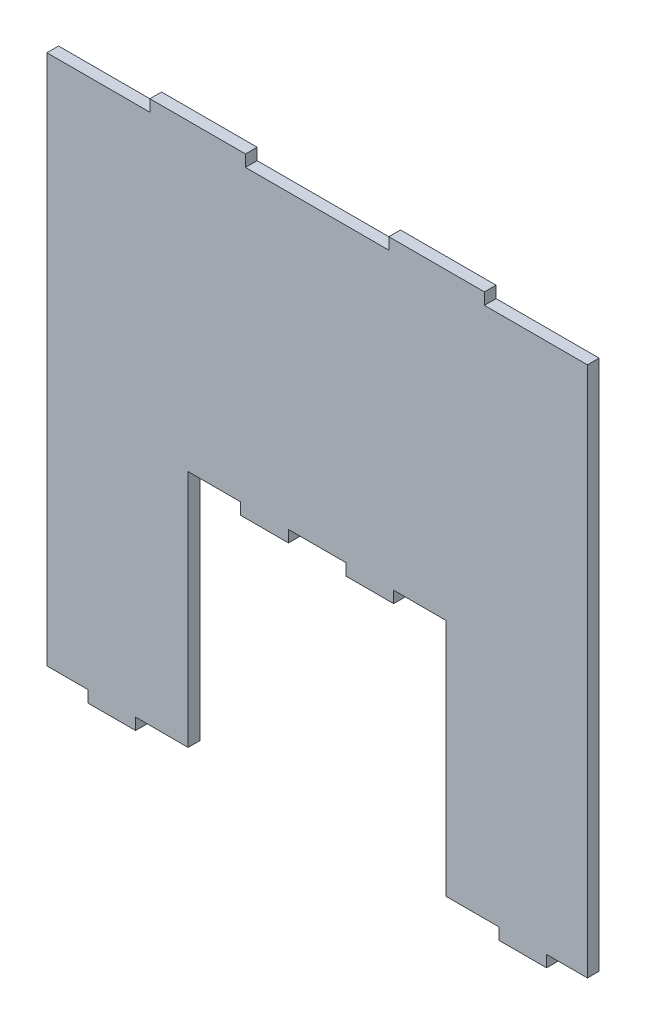
ISO-10303-21;
HEADER;
FILE_DESCRIPTION(('STEP AP214'),'2;1');
FILE_NAME('part.step','',(''),(''),'','','');
FILE_SCHEMA(('AUTOMOTIVE_DESIGN { 1 0 10303 214 1 1 1 1 }'));
ENDSEC;
DATA;
#1=APPLICATION_CONTEXT('core data for automotive mechanical design processes');
#2=APPLICATION_PROTOCOL_DEFINITION('international standard','automotive_design',2000,#1);
#3=PRODUCT_CONTEXT('',#1,'mechanical');
#4=PRODUCT('Part','Part','',(#3));
#5=PRODUCT_RELATED_PRODUCT_CATEGORY('part','',(#4));
#6=PRODUCT_DEFINITION_FORMATION('','',#4);
#7=PRODUCT_DEFINITION_CONTEXT('part definition',#1,'design');
#8=PRODUCT_DEFINITION('design','',#6,#7);
#9=PRODUCT_DEFINITION_SHAPE('','',#8);
#10=(LENGTH_UNIT() NAMED_UNIT(*) SI_UNIT(.MILLI.,.METRE.));
#11=(NAMED_UNIT(*) PLANE_ANGLE_UNIT() SI_UNIT($,.RADIAN.));
#12=(NAMED_UNIT(*) SI_UNIT($,.STERADIAN.) SOLID_ANGLE_UNIT());
#13=UNCERTAINTY_MEASURE_WITH_UNIT(LENGTH_MEASURE(1.E-05),#10,'distance_accuracy_value','');
#14=(GEOMETRIC_REPRESENTATION_CONTEXT(3) GLOBAL_UNCERTAINTY_ASSIGNED_CONTEXT((#13)) GLOBAL_UNIT_ASSIGNED_CONTEXT((#10,
#11,#12)) REPRESENTATION_CONTEXT('',''));
#15=CARTESIAN_POINT('',(0.,0.,0.));
#16=DIRECTION('',(0.,0.,1.));
#17=DIRECTION('',(1.,0.,0.));
#18=AXIS2_PLACEMENT_3D('',#15,#16,#17);
#19=CARTESIAN_POINT('',(35.,55.56,2.44));
#20=DIRECTION('',(0.,-1.,0.));
#21=DIRECTION('',(1.,0.,0.));
#22=AXIS2_PLACEMENT_3D('',#19,#20,#21);
#23=PLANE('',#22);
#24=DIRECTION('',(-1.,0.,0.));
#25=VECTOR('',#24,1.);
#26=CARTESIAN_POINT('',(35.,55.56,0.));
#27=LINE('',#26,#25);
#28=CARTESIAN_POINT('',(56.56,55.56,0.));
#29=VERTEX_POINT('',#28);
#30=CARTESIAN_POINT('',(35.,55.56,0.));
#31=VERTEX_POINT('',#30);
#32=EDGE_CURVE('E274',#29,#31,#27,.T.);
#33=ORIENTED_EDGE('',*,*,#32,.T.);
#34=DIRECTION('',(0.,0.,-1.));
#35=VECTOR('',#34,1.);
#36=CARTESIAN_POINT('',(35.,55.56,2.44));
#37=LINE('',#36,#35);
#38=CARTESIAN_POINT('',(35.,55.56,2.44));
#39=VERTEX_POINT('',#38);
#40=EDGE_CURVE('E11',#39,#31,#37,.T.);
#41=ORIENTED_EDGE('',*,*,#40,.F.);
#42=DIRECTION('',(-1.,0.,0.));
#43=VECTOR('',#42,1.);
#44=CARTESIAN_POINT('',(35.,55.56,2.44));
#45=LINE('',#44,#43);
#46=CARTESIAN_POINT('',(56.56,55.56,2.44));
#47=VERTEX_POINT('',#46);
#48=EDGE_CURVE('E336',#47,#39,#45,.T.);
#49=ORIENTED_EDGE('',*,*,#48,.F.);
#50=DIRECTION('',(0.,0.,-1.));
#51=VECTOR('',#50,1.);
#52=CARTESIAN_POINT('',(56.56,55.56,2.44));
#53=LINE('',#52,#51);
#54=EDGE_CURVE('E270',#47,#29,#53,.T.);
#55=ORIENTED_EDGE('',*,*,#54,.T.);
#56=EDGE_LOOP('',(#33,#41,#49,#55));
#57=FACE_BOUND('',#56,.T.);
#58=ADVANCED_FACE('F34',(#57),#23,.F.);
#59=CARTESIAN_POINT('',(35.,58.,2.44));
#60=DIRECTION('',(-1.,0.,0.));
#61=DIRECTION('',(0.,-1.,0.));
#62=AXIS2_PLACEMENT_3D('',#59,#60,#61);
#63=PLANE('',#62);
#64=DIRECTION('',(0.,1.,0.));
#65=VECTOR('',#64,1.);
#66=CARTESIAN_POINT('',(35.,58.,0.));
#67=LINE('',#66,#65);
#68=CARTESIAN_POINT('',(35.,58.,0.));
#69=VERTEX_POINT('',#68);
#70=EDGE_CURVE('E277',#31,#69,#67,.T.);
#71=ORIENTED_EDGE('',*,*,#70,.T.);
#72=DIRECTION('',(0.,0.,-1.));
#73=VECTOR('',#72,1.);
#74=CARTESIAN_POINT('',(35.,58.,2.44));
#75=LINE('',#74,#73);
#76=CARTESIAN_POINT('',(35.,58.,2.44));
#77=VERTEX_POINT('',#76);
#78=EDGE_CURVE('E42',#77,#69,#75,.T.);
#79=ORIENTED_EDGE('',*,*,#78,.F.);
#80=DIRECTION('',(0.,1.,0.));
#81=VECTOR('',#80,1.);
#82=CARTESIAN_POINT('',(35.,58.,2.44));
#83=LINE('',#82,#81);
#84=EDGE_CURVE('E165',#39,#77,#83,.T.);
#85=ORIENTED_EDGE('',*,*,#84,.F.);
#86=ORIENTED_EDGE('',*,*,#40,.T.);
#87=EDGE_LOOP('',(#71,#79,#85,#86));
#88=FACE_BOUND('',#87,.T.);
#89=ADVANCED_FACE('F514',(#88),#63,.F.);
#90=CARTESIAN_POINT('',(35.,58.,2.44));
#91=DIRECTION('',(0.,-1.,0.));
#92=DIRECTION('',(0.,0.,-1.));
#93=AXIS2_PLACEMENT_3D('',#90,#91,#92);
#94=PLANE('',#93);
#95=DIRECTION('',(-1.,0.,0.));
#96=VECTOR('',#95,1.);
#97=CARTESIAN_POINT('',(35.,58.,0.));
#98=LINE('',#97,#96);
#99=CARTESIAN_POINT('',(15.,58.,0.));
#100=VERTEX_POINT('',#99);
#101=EDGE_CURVE('E279',#69,#100,#98,.T.);
#102=ORIENTED_EDGE('',*,*,#101,.T.);
#103=DIRECTION('',(0.,0.,-1.));
#104=VECTOR('',#103,1.);
#105=CARTESIAN_POINT('',(15.,58.,2.44));
#106=LINE('',#105,#104);
#107=CARTESIAN_POINT('',(15.,58.,2.44));
#108=VERTEX_POINT('',#107);
#109=EDGE_CURVE('E415',#108,#100,#106,.T.);
#110=ORIENTED_EDGE('',*,*,#109,.F.);
#111=DIRECTION('',(-1.,0.,0.));
#112=VECTOR('',#111,1.);
#113=CARTESIAN_POINT('',(35.,58.,2.44));
#114=LINE('',#113,#112);
#115=EDGE_CURVE('E423',#77,#108,#114,.T.);
#116=ORIENTED_EDGE('',*,*,#115,.F.);
#117=ORIENTED_EDGE('',*,*,#78,.T.);
#118=EDGE_LOOP('',(#102,#110,#116,#117));
#119=FACE_BOUND('',#118,.T.);
#120=ADVANCED_FACE('F421',(#119),#94,.F.);
#121=CARTESIAN_POINT('',(15.,58.,2.44));
#122=DIRECTION('',(1.,0.,0.));
#123=DIRECTION('',(0.,1.,0.));
#124=AXIS2_PLACEMENT_3D('',#121,#122,#123);
#125=PLANE('',#124);
#126=DIRECTION('',(0.,-1.,0.));
#127=VECTOR('',#126,1.);
#128=CARTESIAN_POINT('',(15.,58.,0.));
#129=LINE('',#128,#127);
#130=CARTESIAN_POINT('',(15.,55.56,0.));
#131=VERTEX_POINT('',#130);
#132=EDGE_CURVE('E281',#100,#131,#129,.T.);
#133=ORIENTED_EDGE('',*,*,#132,.T.);
#134=DIRECTION('',(0.,0.,-1.));
#135=VECTOR('',#134,1.);
#136=CARTESIAN_POINT('',(15.,55.56,2.44));
#137=LINE('',#136,#135);
#138=CARTESIAN_POINT('',(15.,55.56,2.44));
#139=VERTEX_POINT('',#138);
#140=EDGE_CURVE('E412',#139,#131,#137,.T.);
#141=ORIENTED_EDGE('',*,*,#140,.F.);
#142=DIRECTION('',(0.,-1.,0.));
#143=VECTOR('',#142,1.);
#144=CARTESIAN_POINT('',(15.,58.,2.44));
#145=LINE('',#144,#143);
#146=EDGE_CURVE('E441',#108,#139,#145,.T.);
#147=ORIENTED_EDGE('',*,*,#146,.F.);
#148=ORIENTED_EDGE('',*,*,#109,.T.);
#149=EDGE_LOOP('',(#133,#141,#147,#148));
#150=FACE_BOUND('',#149,.T.);
#151=ADVANCED_FACE('F432',(#150),#125,.F.);
#152=CARTESIAN_POINT('',(-14.9999999999999,55.56,2.44));
#153=DIRECTION('',(0.,-1.,0.));
#154=DIRECTION('',(1.,0.,0.));
#155=AXIS2_PLACEMENT_3D('',#152,#153,#154);
#156=PLANE('',#155);
#157=DIRECTION('',(-1.,0.,0.));
#158=VECTOR('',#157,1.);
#159=CARTESIAN_POINT('',(-14.9999999999999,55.56,0.));
#160=LINE('',#159,#158);
#161=CARTESIAN_POINT('',(-14.9999999999999,55.56,0.));
#162=VERTEX_POINT('',#161);
#163=EDGE_CURVE('E283',#131,#162,#160,.T.);
#164=ORIENTED_EDGE('',*,*,#163,.T.);
#165=DIRECTION('',(0.,0.,-1.));
#166=VECTOR('',#165,1.);
#167=CARTESIAN_POINT('',(-14.9999999999999,55.56,2.44));
#168=LINE('',#167,#166);
#169=CARTESIAN_POINT('',(-14.9999999999999,55.56,2.44));
#170=VERTEX_POINT('',#169);
#171=EDGE_CURVE('E409',#170,#162,#168,.T.);
#172=ORIENTED_EDGE('',*,*,#171,.F.);
#173=DIRECTION('',(-1.,0.,0.));
#174=VECTOR('',#173,1.);
#175=CARTESIAN_POINT('',(-14.9999999999999,55.56,2.44));
#176=LINE('',#175,#174);
#177=EDGE_CURVE('E438',#139,#170,#176,.T.);
#178=ORIENTED_EDGE('',*,*,#177,.F.);
#179=ORIENTED_EDGE('',*,*,#140,.T.);
#180=EDGE_LOOP('',(#164,#172,#178,#179));
#181=FACE_BOUND('',#180,.T.);
#182=ADVANCED_FACE('F436',(#181),#156,.F.);
#183=CARTESIAN_POINT('',(-14.9999999999999,58.,2.44));
#184=DIRECTION('',(-1.,0.,0.));
#185=DIRECTION('',(0.,-1.,0.));
#186=AXIS2_PLACEMENT_3D('',#183,#184,#185);
#187=PLANE('',#186);
#188=DIRECTION('',(0.,1.,0.));
#189=VECTOR('',#188,1.);
#190=CARTESIAN_POINT('',(-14.9999999999999,58.,0.));
#191=LINE('',#190,#189);
#192=CARTESIAN_POINT('',(-14.9999999999999,58.,0.));
#193=VERTEX_POINT('',#192);
#194=EDGE_CURVE('E285',#162,#193,#191,.T.);
#195=ORIENTED_EDGE('',*,*,#194,.T.);
#196=DIRECTION('',(0.,0.,-1.));
#197=VECTOR('',#196,1.);
#198=CARTESIAN_POINT('',(-14.9999999999999,58.,2.44));
#199=LINE('',#198,#197);
#200=CARTESIAN_POINT('',(-14.9999999999999,58.,2.44));
#201=VERTEX_POINT('',#200);
#202=EDGE_CURVE('E406',#201,#193,#199,.T.);
#203=ORIENTED_EDGE('',*,*,#202,.F.);
#204=DIRECTION('',(0.,1.,0.));
#205=VECTOR('',#204,1.);
#206=CARTESIAN_POINT('',(-14.9999999999999,58.,2.44));
#207=LINE('',#206,#205);
#208=EDGE_CURVE('E440',#170,#201,#207,.T.);
#209=ORIENTED_EDGE('',*,*,#208,.F.);
#210=ORIENTED_EDGE('',*,*,#171,.T.);
#211=EDGE_LOOP('',(#195,#203,#209,#210));
#212=FACE_BOUND('',#211,.T.);
#213=ADVANCED_FACE('F527',(#212),#187,.F.);
#214=CARTESIAN_POINT('',(-34.9999999999999,58.,2.44));
#215=DIRECTION('',(0.,-1.,0.));
#216=DIRECTION('',(0.,0.,-1.));
#217=AXIS2_PLACEMENT_3D('',#214,#215,#216);
#218=PLANE('',#217);
#219=DIRECTION('',(-1.,0.,0.));
#220=VECTOR('',#219,1.);
#221=CARTESIAN_POINT('',(-34.9999999999999,58.,0.));
#222=LINE('',#221,#220);
#223=CARTESIAN_POINT('',(-34.9999999999999,58.,0.));
#224=VERTEX_POINT('',#223);
#225=EDGE_CURVE('E287',#193,#224,#222,.T.);
#226=ORIENTED_EDGE('',*,*,#225,.T.);
#227=DIRECTION('',(0.,0.,-1.));
#228=VECTOR('',#227,1.);
#229=CARTESIAN_POINT('',(-34.9999999999999,58.,2.44));
#230=LINE('',#229,#228);
#231=CARTESIAN_POINT('',(-34.9999999999999,58.,2.44));
#232=VERTEX_POINT('',#231);
#233=EDGE_CURVE('E403',#232,#224,#230,.T.);
#234=ORIENTED_EDGE('',*,*,#233,.F.);
#235=DIRECTION('',(-1.,0.,0.));
#236=VECTOR('',#235,1.);
#237=CARTESIAN_POINT('',(-34.9999999999999,58.,2.44));
#238=LINE('',#237,#236);
#239=EDGE_CURVE('E443',#201,#232,#238,.T.);
#240=ORIENTED_EDGE('',*,*,#239,.F.);
#241=ORIENTED_EDGE('',*,*,#202,.T.);
#242=EDGE_LOOP('',(#226,#234,#240,#241));
#243=FACE_BOUND('',#242,.T.);
#244=ADVANCED_FACE('F530',(#243),#218,.F.);
#245=CARTESIAN_POINT('',(-34.9999999999999,58.,2.44));
#246=DIRECTION('',(1.,0.,0.));
#247=DIRECTION('',(0.,1.,0.));
#248=AXIS2_PLACEMENT_3D('',#245,#246,#247);
#249=PLANE('',#248);
#250=DIRECTION('',(0.,-1.,0.));
#251=VECTOR('',#250,1.);
#252=CARTESIAN_POINT('',(-34.9999999999999,58.,0.));
#253=LINE('',#252,#251);
#254=CARTESIAN_POINT('',(-34.9999999999999,55.56,0.));
#255=VERTEX_POINT('',#254);
#256=EDGE_CURVE('E289',#224,#255,#253,.T.);
#257=ORIENTED_EDGE('',*,*,#256,.T.);
#258=DIRECTION('',(0.,0.,-1.));
#259=VECTOR('',#258,1.);
#260=CARTESIAN_POINT('',(-34.9999999999999,55.56,2.44));
#261=LINE('',#260,#259);
#262=CARTESIAN_POINT('',(-34.9999999999999,55.56,2.44));
#263=VERTEX_POINT('',#262);
#264=EDGE_CURVE('E400',#263,#255,#261,.T.);
#265=ORIENTED_EDGE('',*,*,#264,.F.);
#266=DIRECTION('',(0.,-1.,0.));
#267=VECTOR('',#266,1.);
#268=CARTESIAN_POINT('',(-34.9999999999999,58.,2.44));
#269=LINE('',#268,#267);
#270=EDGE_CURVE('E449',#232,#263,#269,.T.);
#271=ORIENTED_EDGE('',*,*,#270,.F.);
#272=ORIENTED_EDGE('',*,*,#233,.T.);
#273=EDGE_LOOP('',(#257,#265,#271,#272));
#274=FACE_BOUND('',#273,.T.);
#275=ADVANCED_FACE('F534',(#274),#249,.F.);
#276=CARTESIAN_POINT('',(-56.56,55.56,2.44));
#277=DIRECTION('',(0.,-1.,0.));
#278=DIRECTION('',(1.,0.,0.));
#279=AXIS2_PLACEMENT_3D('',#276,#277,#278);
#280=PLANE('',#279);
#281=DIRECTION('',(-1.,0.,0.));
#282=VECTOR('',#281,1.);
#283=CARTESIAN_POINT('',(-56.56,55.56,0.));
#284=LINE('',#283,#282);
#285=CARTESIAN_POINT('',(-56.56,55.56,0.));
#286=VERTEX_POINT('',#285);
#287=EDGE_CURVE('E291',#255,#286,#284,.T.);
#288=ORIENTED_EDGE('',*,*,#287,.T.);
#289=DIRECTION('',(0.,0.,-1.));
#290=VECTOR('',#289,1.);
#291=CARTESIAN_POINT('',(-56.56,55.56,2.44));
#292=LINE('',#291,#290);
#293=CARTESIAN_POINT('',(-56.56,55.56,2.44));
#294=VERTEX_POINT('',#293);
#295=EDGE_CURVE('E397',#294,#286,#292,.T.);
#296=ORIENTED_EDGE('',*,*,#295,.F.);
#297=DIRECTION('',(-1.,0.,0.));
#298=VECTOR('',#297,1.);
#299=CARTESIAN_POINT('',(-56.56,55.56,2.44));
#300=LINE('',#299,#298);
#301=EDGE_CURVE('E451',#263,#294,#300,.T.);
#302=ORIENTED_EDGE('',*,*,#301,.F.);
#303=ORIENTED_EDGE('',*,*,#264,.T.);
#304=EDGE_LOOP('',(#288,#296,#302,#303));
#305=FACE_BOUND('',#304,.T.);
#306=ADVANCED_FACE('F538',(#305),#280,.F.);
#307=CARTESIAN_POINT('',(-56.56,-55.56,2.44));
#308=DIRECTION('',(1.,0.,0.));
#309=DIRECTION('',(0.,0.,-1.));
#310=AXIS2_PLACEMENT_3D('',#307,#308,#309);
#311=PLANE('',#310);
#312=DIRECTION('',(0.,-1.,0.));
#313=VECTOR('',#312,1.);
#314=CARTESIAN_POINT('',(-56.56,-55.56,0.));
#315=LINE('',#314,#313);
#316=CARTESIAN_POINT('',(-56.56,-55.56,0.));
#317=VERTEX_POINT('',#316);
#318=EDGE_CURVE('E293',#286,#317,#315,.T.);
#319=ORIENTED_EDGE('',*,*,#318,.T.);
#320=DIRECTION('',(0.,0.,-1.));
#321=VECTOR('',#320,1.);
#322=CARTESIAN_POINT('',(-56.56,-55.56,2.44));
#323=LINE('',#322,#321);
#324=CARTESIAN_POINT('',(-56.56,-55.56,2.44));
#325=VERTEX_POINT('',#324);
#326=EDGE_CURVE('E394',#325,#317,#323,.T.);
#327=ORIENTED_EDGE('',*,*,#326,.F.);
#328=DIRECTION('',(0.,-1.,0.));
#329=VECTOR('',#328,1.);
#330=CARTESIAN_POINT('',(-56.56,-55.56,2.44));
#331=LINE('',#330,#329);
#332=EDGE_CURVE('E453',#294,#325,#331,.T.);
#333=ORIENTED_EDGE('',*,*,#332,.F.);
#334=ORIENTED_EDGE('',*,*,#295,.T.);
#335=EDGE_LOOP('',(#319,#327,#333,#334));
#336=FACE_BOUND('',#335,.T.);
#337=ADVANCED_FACE('F542',(#336),#311,.F.);
#338=CARTESIAN_POINT('',(-56.56,-55.56,2.44));
#339=DIRECTION('',(0.,1.,0.));
#340=DIRECTION('',(-1.,0.,0.));
#341=AXIS2_PLACEMENT_3D('',#338,#339,#340);
#342=PLANE('',#341);
#343=DIRECTION('',(1.,0.,0.));
#344=VECTOR('',#343,1.);
#345=CARTESIAN_POINT('',(-56.56,-55.56,0.));
#346=LINE('',#345,#344);
#347=CARTESIAN_POINT('',(-48.,-55.56,0.));
#348=VERTEX_POINT('',#347);
#349=EDGE_CURVE('E295',#317,#348,#346,.T.);
#350=ORIENTED_EDGE('',*,*,#349,.T.);
#351=DIRECTION('',(0.,0.,-1.));
#352=VECTOR('',#351,1.);
#353=CARTESIAN_POINT('',(-48.,-55.56,2.44));
#354=LINE('',#353,#352);
#355=CARTESIAN_POINT('',(-48.,-55.56,2.44));
#356=VERTEX_POINT('',#355);
#357=EDGE_CURVE('E391',#356,#348,#354,.T.);
#358=ORIENTED_EDGE('',*,*,#357,.F.);
#359=DIRECTION('',(1.,0.,0.));
#360=VECTOR('',#359,1.);
#361=CARTESIAN_POINT('',(-56.56,-55.56,2.44));
#362=LINE('',#361,#360);
#363=EDGE_CURVE('E455',#325,#356,#362,.T.);
#364=ORIENTED_EDGE('',*,*,#363,.F.);
#365=ORIENTED_EDGE('',*,*,#326,.T.);
#366=EDGE_LOOP('',(#350,#358,#364,#365));
#367=FACE_BOUND('',#366,.T.);
#368=ADVANCED_FACE('F546',(#367),#342,.F.);
#369=CARTESIAN_POINT('',(-48.,-58.,2.44));
#370=DIRECTION('',(1.,0.,0.));
#371=DIRECTION('',(0.,0.,-1.));
#372=AXIS2_PLACEMENT_3D('',#369,#370,#371);
#373=PLANE('',#372);
#374=DIRECTION('',(0.,-1.,0.));
#375=VECTOR('',#374,1.);
#376=CARTESIAN_POINT('',(-48.,-58.,0.));
#377=LINE('',#376,#375);
#378=CARTESIAN_POINT('',(-48.,-58.,0.));
#379=VERTEX_POINT('',#378);
#380=EDGE_CURVE('E297',#348,#379,#377,.T.);
#381=ORIENTED_EDGE('',*,*,#380,.T.);
#382=DIRECTION('',(0.,0.,-1.));
#383=VECTOR('',#382,1.);
#384=CARTESIAN_POINT('',(-48.,-58.,2.44));
#385=LINE('',#384,#383);
#386=CARTESIAN_POINT('',(-48.,-58.,2.44));
#387=VERTEX_POINT('',#386);
#388=EDGE_CURVE('E388',#387,#379,#385,.T.);
#389=ORIENTED_EDGE('',*,*,#388,.F.);
#390=DIRECTION('',(0.,-1.,0.));
#391=VECTOR('',#390,1.);
#392=CARTESIAN_POINT('',(-48.,-58.,2.44));
#393=LINE('',#392,#391);
#394=EDGE_CURVE('E457',#356,#387,#393,.T.);
#395=ORIENTED_EDGE('',*,*,#394,.F.);
#396=ORIENTED_EDGE('',*,*,#357,.T.);
#397=EDGE_LOOP('',(#381,#389,#395,#396));
#398=FACE_BOUND('',#397,.T.);
#399=ADVANCED_FACE('F550',(#398),#373,.F.);
#400=CARTESIAN_POINT('',(-48.,-58.,2.44));
#401=DIRECTION('',(0.,1.,0.));
#402=DIRECTION('',(-1.,0.,0.));
#403=AXIS2_PLACEMENT_3D('',#400,#401,#402);
#404=PLANE('',#403);
#405=DIRECTION('',(1.,0.,0.));
#406=VECTOR('',#405,1.);
#407=CARTESIAN_POINT('',(-48.,-58.,0.));
#408=LINE('',#407,#406);
#409=CARTESIAN_POINT('',(-38.,-58.,0.));
#410=VERTEX_POINT('',#409);
#411=EDGE_CURVE('E299',#379,#410,#408,.T.);
#412=ORIENTED_EDGE('',*,*,#411,.T.);
#413=DIRECTION('',(0.,0.,-1.));
#414=VECTOR('',#413,1.);
#415=CARTESIAN_POINT('',(-38.,-58.,2.44));
#416=LINE('',#415,#414);
#417=CARTESIAN_POINT('',(-38.,-58.,2.44));
#418=VERTEX_POINT('',#417);
#419=EDGE_CURVE('E385',#418,#410,#416,.T.);
#420=ORIENTED_EDGE('',*,*,#419,.F.);
#421=DIRECTION('',(1.,0.,0.));
#422=VECTOR('',#421,1.);
#423=CARTESIAN_POINT('',(-48.,-58.,2.44));
#424=LINE('',#423,#422);
#425=EDGE_CURVE('E459',#387,#418,#424,.T.);
#426=ORIENTED_EDGE('',*,*,#425,.F.);
#427=ORIENTED_EDGE('',*,*,#388,.T.);
#428=EDGE_LOOP('',(#412,#420,#426,#427));
#429=FACE_BOUND('',#428,.T.);
#430=ADVANCED_FACE('F554',(#429),#404,.F.);
#431=CARTESIAN_POINT('',(-38.,-58.,2.44));
#432=DIRECTION('',(-1.,0.,0.));
#433=DIRECTION('',(0.,-1.,0.));
#434=AXIS2_PLACEMENT_3D('',#431,#432,#433);
#435=PLANE('',#434);
#436=DIRECTION('',(0.,1.,0.));
#437=VECTOR('',#436,1.);
#438=CARTESIAN_POINT('',(-38.,-58.,0.));
#439=LINE('',#438,#437);
#440=CARTESIAN_POINT('',(-38.,-55.56,0.));
#441=VERTEX_POINT('',#440);
#442=EDGE_CURVE('E301',#410,#441,#439,.T.);
#443=ORIENTED_EDGE('',*,*,#442,.T.);
#444=DIRECTION('',(0.,0.,-1.));
#445=VECTOR('',#444,1.);
#446=CARTESIAN_POINT('',(-38.,-55.56,2.44));
#447=LINE('',#446,#445);
#448=CARTESIAN_POINT('',(-38.,-55.56,2.44));
#449=VERTEX_POINT('',#448);
#450=EDGE_CURVE('E382',#449,#441,#447,.T.);
#451=ORIENTED_EDGE('',*,*,#450,.F.);
#452=DIRECTION('',(0.,1.,0.));
#453=VECTOR('',#452,1.);
#454=CARTESIAN_POINT('',(-38.,-58.,2.44));
#455=LINE('',#454,#453);
#456=EDGE_CURVE('E461',#418,#449,#455,.T.);
#457=ORIENTED_EDGE('',*,*,#456,.F.);
#458=ORIENTED_EDGE('',*,*,#419,.T.);
#459=EDGE_LOOP('',(#443,#451,#457,#458));
#460=FACE_BOUND('',#459,.T.);
#461=ADVANCED_FACE('F558',(#460),#435,.F.);
#462=CARTESIAN_POINT('',(-38.,-55.56,2.44));
#463=DIRECTION('',(0.,1.,0.));
#464=DIRECTION('',(-1.,0.,0.));
#465=AXIS2_PLACEMENT_3D('',#462,#463,#464);
#466=PLANE('',#465);
#467=DIRECTION('',(1.,0.,0.));
#468=VECTOR('',#467,1.);
#469=CARTESIAN_POINT('',(-38.,-55.56,0.));
#470=LINE('',#469,#468);
#471=CARTESIAN_POINT('',(-27.,-55.56,0.));
#472=VERTEX_POINT('',#471);
#473=EDGE_CURVE('E303',#441,#472,#470,.T.);
#474=ORIENTED_EDGE('',*,*,#473,.T.);
#475=DIRECTION('',(0.,0.,-1.));
#476=VECTOR('',#475,1.);
#477=CARTESIAN_POINT('',(-27.,-55.56,2.44));
#478=LINE('',#477,#476);
#479=CARTESIAN_POINT('',(-27.,-55.56,2.44));
#480=VERTEX_POINT('',#479);
#481=EDGE_CURVE('E379',#480,#472,#478,.T.);
#482=ORIENTED_EDGE('',*,*,#481,.F.);
#483=DIRECTION('',(1.,0.,0.));
#484=VECTOR('',#483,1.);
#485=CARTESIAN_POINT('',(-38.,-55.56,2.44));
#486=LINE('',#485,#484);
#487=EDGE_CURVE('E463',#449,#480,#486,.T.);
#488=ORIENTED_EDGE('',*,*,#487,.F.);
#489=ORIENTED_EDGE('',*,*,#450,.T.);
#490=EDGE_LOOP('',(#474,#482,#488,#489));
#491=FACE_BOUND('',#490,.T.);
#492=ADVANCED_FACE('F562',(#491),#466,.F.);
#493=CARTESIAN_POINT('',(-27.,-5.56,2.44));
#494=DIRECTION('',(-1.,0.,0.));
#495=DIRECTION('',(0.,-1.,0.));
#496=AXIS2_PLACEMENT_3D('',#493,#494,#495);
#497=PLANE('',#496);
#498=DIRECTION('',(0.,1.,0.));
#499=VECTOR('',#498,1.);
#500=CARTESIAN_POINT('',(-27.,-5.56,0.));
#501=LINE('',#500,#499);
#502=CARTESIAN_POINT('',(-27.,-5.56,0.));
#503=VERTEX_POINT('',#502);
#504=EDGE_CURVE('E305',#472,#503,#501,.T.);
#505=ORIENTED_EDGE('',*,*,#504,.T.);
#506=DIRECTION('',(0.,0.,-1.));
#507=VECTOR('',#506,1.);
#508=CARTESIAN_POINT('',(-27.,-5.56,2.44));
#509=LINE('',#508,#507);
#510=CARTESIAN_POINT('',(-27.,-5.56,2.44));
#511=VERTEX_POINT('',#510);
#512=EDGE_CURVE('E376',#511,#503,#509,.T.);
#513=ORIENTED_EDGE('',*,*,#512,.F.);
#514=DIRECTION('',(0.,1.,0.));
#515=VECTOR('',#514,1.);
#516=CARTESIAN_POINT('',(-27.,-5.56,2.44));
#517=LINE('',#516,#515);
#518=EDGE_CURVE('E465',#480,#511,#517,.T.);
#519=ORIENTED_EDGE('',*,*,#518,.F.);
#520=ORIENTED_EDGE('',*,*,#481,.T.);
#521=EDGE_LOOP('',(#505,#513,#519,#520));
#522=FACE_BOUND('',#521,.T.);
#523=ADVANCED_FACE('F566',(#522),#497,.F.);
#524=CARTESIAN_POINT('',(-16.,-5.56000000000001,2.44));
#525=DIRECTION('',(0.,1.,0.));
#526=DIRECTION('',(-1.,0.,0.));
#527=AXIS2_PLACEMENT_3D('',#524,#525,#526);
#528=PLANE('',#527);
#529=DIRECTION('',(1.,0.,0.));
#530=VECTOR('',#529,1.);
#531=CARTESIAN_POINT('',(-16.,-5.56000000000001,0.));
#532=LINE('',#531,#530);
#533=CARTESIAN_POINT('',(-16.,-5.56000000000001,0.));
#534=VERTEX_POINT('',#533);
#535=EDGE_CURVE('E307',#503,#534,#532,.T.);
#536=ORIENTED_EDGE('',*,*,#535,.T.);
#537=DIRECTION('',(0.,0.,-1.));
#538=VECTOR('',#537,1.);
#539=CARTESIAN_POINT('',(-16.,-5.56000000000001,2.44));
#540=LINE('',#539,#538);
#541=CARTESIAN_POINT('',(-16.,-5.56000000000001,2.44));
#542=VERTEX_POINT('',#541);
#543=EDGE_CURVE('E373',#542,#534,#540,.T.);
#544=ORIENTED_EDGE('',*,*,#543,.F.);
#545=DIRECTION('',(1.,0.,0.));
#546=VECTOR('',#545,1.);
#547=CARTESIAN_POINT('',(-16.,-5.56000000000001,2.44));
#548=LINE('',#547,#546);
#549=EDGE_CURVE('E467',#511,#542,#548,.T.);
#550=ORIENTED_EDGE('',*,*,#549,.F.);
#551=ORIENTED_EDGE('',*,*,#512,.T.);
#552=EDGE_LOOP('',(#536,#544,#550,#551));
#553=FACE_BOUND('',#552,.T.);
#554=ADVANCED_FACE('F570',(#553),#528,.F.);
#555=CARTESIAN_POINT('',(-16.,-5.56000000000001,2.44));
#556=DIRECTION('',(1.,0.,0.));
#557=DIRECTION('',(0.,1.,0.));
#558=AXIS2_PLACEMENT_3D('',#555,#556,#557);
#559=PLANE('',#558);
#560=DIRECTION('',(0.,-1.,0.));
#561=VECTOR('',#560,1.);
#562=CARTESIAN_POINT('',(-16.,-5.56000000000001,0.));
#563=LINE('',#562,#561);
#564=CARTESIAN_POINT('',(-16.,-8.00000000000001,0.));
#565=VERTEX_POINT('',#564);
#566=EDGE_CURVE('E309',#534,#565,#563,.T.);
#567=ORIENTED_EDGE('',*,*,#566,.T.);
#568=DIRECTION('',(0.,0.,-1.));
#569=VECTOR('',#568,1.);
#570=CARTESIAN_POINT('',(-16.,-8.00000000000001,2.44));
#571=LINE('',#570,#569);
#572=CARTESIAN_POINT('',(-16.,-8.00000000000001,2.44));
#573=VERTEX_POINT('',#572);
#574=EDGE_CURVE('E370',#573,#565,#571,.T.);
#575=ORIENTED_EDGE('',*,*,#574,.F.);
#576=DIRECTION('',(0.,-1.,0.));
#577=VECTOR('',#576,1.);
#578=CARTESIAN_POINT('',(-16.,-5.56000000000001,2.44));
#579=LINE('',#578,#577);
#580=EDGE_CURVE('E469',#542,#573,#579,.T.);
#581=ORIENTED_EDGE('',*,*,#580,.F.);
#582=ORIENTED_EDGE('',*,*,#543,.T.);
#583=EDGE_LOOP('',(#567,#575,#581,#582));
#584=FACE_BOUND('',#583,.T.);
#585=ADVANCED_FACE('F574',(#584),#559,.F.);
#586=CARTESIAN_POINT('',(-16.,-8.00000000000001,2.44));
#587=DIRECTION('',(0.,1.,0.));
#588=DIRECTION('',(0.,0.,1.));
#589=AXIS2_PLACEMENT_3D('',#586,#587,#588);
#590=PLANE('',#589);
#591=DIRECTION('',(1.,0.,0.));
#592=VECTOR('',#591,1.);
#593=CARTESIAN_POINT('',(-16.,-8.00000000000001,0.));
#594=LINE('',#593,#592);
#595=CARTESIAN_POINT('',(-6.,-8.00000000000001,0.));
#596=VERTEX_POINT('',#595);
#597=EDGE_CURVE('E311',#565,#596,#594,.T.);
#598=ORIENTED_EDGE('',*,*,#597,.T.);
#599=DIRECTION('',(0.,0.,-1.));
#600=VECTOR('',#599,1.);
#601=CARTESIAN_POINT('',(-6.,-8.00000000000001,2.44));
#602=LINE('',#601,#600);
#603=CARTESIAN_POINT('',(-6.,-8.00000000000001,2.44));
#604=VERTEX_POINT('',#603);
#605=EDGE_CURVE('E367',#604,#596,#602,.T.);
#606=ORIENTED_EDGE('',*,*,#605,.F.);
#607=DIRECTION('',(1.,0.,0.));
#608=VECTOR('',#607,1.);
#609=CARTESIAN_POINT('',(-16.,-8.00000000000001,2.44));
#610=LINE('',#609,#608);
#611=EDGE_CURVE('E471',#573,#604,#610,.T.);
#612=ORIENTED_EDGE('',*,*,#611,.F.);
#613=ORIENTED_EDGE('',*,*,#574,.T.);
#614=EDGE_LOOP('',(#598,#606,#612,#613));
#615=FACE_BOUND('',#614,.T.);
#616=ADVANCED_FACE('F578',(#615),#590,.F.);
#617=CARTESIAN_POINT('',(-6.,-5.56000000000001,2.44));
#618=DIRECTION('',(-1.,0.,0.));
#619=DIRECTION('',(0.,-1.,0.));
#620=AXIS2_PLACEMENT_3D('',#617,#618,#619);
#621=PLANE('',#620);
#622=DIRECTION('',(0.,1.,0.));
#623=VECTOR('',#622,1.);
#624=CARTESIAN_POINT('',(-6.,-5.56000000000001,0.));
#625=LINE('',#624,#623);
#626=CARTESIAN_POINT('',(-6.,-5.56000000000001,0.));
#627=VERTEX_POINT('',#626);
#628=EDGE_CURVE('E313',#596,#627,#625,.T.);
#629=ORIENTED_EDGE('',*,*,#628,.T.);
#630=DIRECTION('',(0.,0.,-1.));
#631=VECTOR('',#630,1.);
#632=CARTESIAN_POINT('',(-6.,-5.56000000000001,2.44));
#633=LINE('',#632,#631);
#634=CARTESIAN_POINT('',(-6.,-5.56000000000001,2.44));
#635=VERTEX_POINT('',#634);
#636=EDGE_CURVE('E364',#635,#627,#633,.T.);
#637=ORIENTED_EDGE('',*,*,#636,.F.);
#638=DIRECTION('',(0.,1.,0.));
#639=VECTOR('',#638,1.);
#640=CARTESIAN_POINT('',(-6.,-5.56000000000001,2.44));
#641=LINE('',#640,#639);
#642=EDGE_CURVE('E473',#604,#635,#641,.T.);
#643=ORIENTED_EDGE('',*,*,#642,.F.);
#644=ORIENTED_EDGE('',*,*,#605,.T.);
#645=EDGE_LOOP('',(#629,#637,#643,#644));
#646=FACE_BOUND('',#645,.T.);
#647=ADVANCED_FACE('F582',(#646),#621,.F.);
#648=CARTESIAN_POINT('',(6.,-5.56,2.44));
#649=DIRECTION('',(0.,1.,0.));
#650=DIRECTION('',(-1.,0.,0.));
#651=AXIS2_PLACEMENT_3D('',#648,#649,#650);
#652=PLANE('',#651);
#653=DIRECTION('',(1.,0.,0.));
#654=VECTOR('',#653,1.);
#655=CARTESIAN_POINT('',(6.,-5.56,0.));
#656=LINE('',#655,#654);
#657=CARTESIAN_POINT('',(6.,-5.56,0.));
#658=VERTEX_POINT('',#657);
#659=EDGE_CURVE('E315',#627,#658,#656,.T.);
#660=ORIENTED_EDGE('',*,*,#659,.T.);
#661=DIRECTION('',(0.,0.,-1.));
#662=VECTOR('',#661,1.);
#663=CARTESIAN_POINT('',(6.,-5.56,2.44));
#664=LINE('',#663,#662);
#665=CARTESIAN_POINT('',(6.,-5.56,2.44));
#666=VERTEX_POINT('',#665);
#667=EDGE_CURVE('E361',#666,#658,#664,.T.);
#668=ORIENTED_EDGE('',*,*,#667,.F.);
#669=DIRECTION('',(1.,0.,0.));
#670=VECTOR('',#669,1.);
#671=CARTESIAN_POINT('',(6.,-5.56,2.44));
#672=LINE('',#671,#670);
#673=EDGE_CURVE('E475',#635,#666,#672,.T.);
#674=ORIENTED_EDGE('',*,*,#673,.F.);
#675=ORIENTED_EDGE('',*,*,#636,.T.);
#676=EDGE_LOOP('',(#660,#668,#674,#675));
#677=FACE_BOUND('',#676,.T.);
#678=ADVANCED_FACE('F586',(#677),#652,.F.);
#679=CARTESIAN_POINT('',(6.,-5.56,2.44));
#680=DIRECTION('',(1.,0.,0.));
#681=DIRECTION('',(0.,1.,0.));
#682=AXIS2_PLACEMENT_3D('',#679,#680,#681);
#683=PLANE('',#682);
#684=DIRECTION('',(0.,-1.,0.));
#685=VECTOR('',#684,1.);
#686=CARTESIAN_POINT('',(6.,-5.56,0.));
#687=LINE('',#686,#685);
#688=CARTESIAN_POINT('',(6.,-8.00000000000001,0.));
#689=VERTEX_POINT('',#688);
#690=EDGE_CURVE('E317',#658,#689,#687,.T.);
#691=ORIENTED_EDGE('',*,*,#690,.T.);
#692=DIRECTION('',(0.,0.,-1.));
#693=VECTOR('',#692,1.);
#694=CARTESIAN_POINT('',(6.,-8.00000000000001,2.44));
#695=LINE('',#694,#693);
#696=CARTESIAN_POINT('',(6.,-8.00000000000001,2.44));
#697=VERTEX_POINT('',#696);
#698=EDGE_CURVE('E358',#697,#689,#695,.T.);
#699=ORIENTED_EDGE('',*,*,#698,.F.);
#700=DIRECTION('',(0.,-1.,0.));
#701=VECTOR('',#700,1.);
#702=CARTESIAN_POINT('',(6.,-5.56,2.44));
#703=LINE('',#702,#701);
#704=EDGE_CURVE('E477',#666,#697,#703,.T.);
#705=ORIENTED_EDGE('',*,*,#704,.F.);
#706=ORIENTED_EDGE('',*,*,#667,.T.);
#707=EDGE_LOOP('',(#691,#699,#705,#706));
#708=FACE_BOUND('',#707,.T.);
#709=ADVANCED_FACE('F590',(#708),#683,.F.);
#710=CARTESIAN_POINT('',(6.,-8.00000000000001,2.44));
#711=DIRECTION('',(0.,1.,0.));
#712=DIRECTION('',(0.,0.,1.));
#713=AXIS2_PLACEMENT_3D('',#710,#711,#712);
#714=PLANE('',#713);
#715=DIRECTION('',(1.,0.,0.));
#716=VECTOR('',#715,1.);
#717=CARTESIAN_POINT('',(6.,-8.00000000000001,0.));
#718=LINE('',#717,#716);
#719=CARTESIAN_POINT('',(16.,-8.00000000000001,0.));
#720=VERTEX_POINT('',#719);
#721=EDGE_CURVE('E319',#689,#720,#718,.T.);
#722=ORIENTED_EDGE('',*,*,#721,.T.);
#723=DIRECTION('',(0.,0.,-1.));
#724=VECTOR('',#723,1.);
#725=CARTESIAN_POINT('',(16.,-8.00000000000001,2.44));
#726=LINE('',#725,#724);
#727=CARTESIAN_POINT('',(16.,-8.00000000000001,2.44));
#728=VERTEX_POINT('',#727);
#729=EDGE_CURVE('E355',#728,#720,#726,.T.);
#730=ORIENTED_EDGE('',*,*,#729,.F.);
#731=DIRECTION('',(1.,0.,0.));
#732=VECTOR('',#731,1.);
#733=CARTESIAN_POINT('',(6.,-8.00000000000001,2.44));
#734=LINE('',#733,#732);
#735=EDGE_CURVE('E479',#697,#728,#734,.T.);
#736=ORIENTED_EDGE('',*,*,#735,.F.);
#737=ORIENTED_EDGE('',*,*,#698,.T.);
#738=EDGE_LOOP('',(#722,#730,#736,#737));
#739=FACE_BOUND('',#738,.T.);
#740=ADVANCED_FACE('F594',(#739),#714,.F.);
#741=CARTESIAN_POINT('',(16.,-5.56,2.44));
#742=DIRECTION('',(-1.,0.,0.));
#743=DIRECTION('',(0.,-1.,0.));
#744=AXIS2_PLACEMENT_3D('',#741,#742,#743);
#745=PLANE('',#744);
#746=DIRECTION('',(0.,1.,0.));
#747=VECTOR('',#746,1.);
#748=CARTESIAN_POINT('',(16.,-5.56,0.));
#749=LINE('',#748,#747);
#750=CARTESIAN_POINT('',(16.,-5.56,0.));
#751=VERTEX_POINT('',#750);
#752=EDGE_CURVE('E321',#720,#751,#749,.T.);
#753=ORIENTED_EDGE('',*,*,#752,.T.);
#754=DIRECTION('',(0.,0.,-1.));
#755=VECTOR('',#754,1.);
#756=CARTESIAN_POINT('',(16.,-5.56,2.44));
#757=LINE('',#756,#755);
#758=CARTESIAN_POINT('',(16.,-5.56,2.44));
#759=VERTEX_POINT('',#758);
#760=EDGE_CURVE('E352',#759,#751,#757,.T.);
#761=ORIENTED_EDGE('',*,*,#760,.F.);
#762=DIRECTION('',(0.,1.,0.));
#763=VECTOR('',#762,1.);
#764=CARTESIAN_POINT('',(16.,-5.56,2.44));
#765=LINE('',#764,#763);
#766=EDGE_CURVE('E481',#728,#759,#765,.T.);
#767=ORIENTED_EDGE('',*,*,#766,.F.);
#768=ORIENTED_EDGE('',*,*,#729,.T.);
#769=EDGE_LOOP('',(#753,#761,#767,#768));
#770=FACE_BOUND('',#769,.T.);
#771=ADVANCED_FACE('F598',(#770),#745,.F.);
#772=CARTESIAN_POINT('',(27.,-5.56,2.44));
#773=DIRECTION('',(0.,1.,0.));
#774=DIRECTION('',(-1.,0.,0.));
#775=AXIS2_PLACEMENT_3D('',#772,#773,#774);
#776=PLANE('',#775);
#777=DIRECTION('',(1.,0.,0.));
#778=VECTOR('',#777,1.);
#779=CARTESIAN_POINT('',(27.,-5.56,0.));
#780=LINE('',#779,#778);
#781=CARTESIAN_POINT('',(27.,-5.56,0.));
#782=VERTEX_POINT('',#781);
#783=EDGE_CURVE('E323',#751,#782,#780,.T.);
#784=ORIENTED_EDGE('',*,*,#783,.T.);
#785=DIRECTION('',(0.,0.,-1.));
#786=VECTOR('',#785,1.);
#787=CARTESIAN_POINT('',(27.,-5.56,2.44));
#788=LINE('',#787,#786);
#789=CARTESIAN_POINT('',(27.,-5.56,2.44));
#790=VERTEX_POINT('',#789);
#791=EDGE_CURVE('E349',#790,#782,#788,.T.);
#792=ORIENTED_EDGE('',*,*,#791,.F.);
#793=DIRECTION('',(1.,0.,0.));
#794=VECTOR('',#793,1.);
#795=CARTESIAN_POINT('',(27.,-5.56,2.44));
#796=LINE('',#795,#794);
#797=EDGE_CURVE('E483',#759,#790,#796,.T.);
#798=ORIENTED_EDGE('',*,*,#797,.F.);
#799=ORIENTED_EDGE('',*,*,#760,.T.);
#800=EDGE_LOOP('',(#784,#792,#798,#799));
#801=FACE_BOUND('',#800,.T.);
#802=ADVANCED_FACE('F602',(#801),#776,.F.);
#803=CARTESIAN_POINT('',(27.,-55.56,2.44));
#804=DIRECTION('',(1.,0.,0.));
#805=DIRECTION('',(0.,1.,0.));
#806=AXIS2_PLACEMENT_3D('',#803,#804,#805);
#807=PLANE('',#806);
#808=DIRECTION('',(0.,-1.,0.));
#809=VECTOR('',#808,1.);
#810=CARTESIAN_POINT('',(27.,-55.56,0.));
#811=LINE('',#810,#809);
#812=CARTESIAN_POINT('',(27.,-55.56,0.));
#813=VERTEX_POINT('',#812);
#814=EDGE_CURVE('E325',#782,#813,#811,.T.);
#815=ORIENTED_EDGE('',*,*,#814,.T.);
#816=DIRECTION('',(0.,0.,-1.));
#817=VECTOR('',#816,1.);
#818=CARTESIAN_POINT('',(27.,-55.56,2.44));
#819=LINE('',#818,#817);
#820=CARTESIAN_POINT('',(27.,-55.56,2.44));
#821=VERTEX_POINT('',#820);
#822=EDGE_CURVE('E346',#821,#813,#819,.T.);
#823=ORIENTED_EDGE('',*,*,#822,.F.);
#824=DIRECTION('',(0.,-1.,0.));
#825=VECTOR('',#824,1.);
#826=CARTESIAN_POINT('',(27.,-55.56,2.44));
#827=LINE('',#826,#825);
#828=EDGE_CURVE('E485',#790,#821,#827,.T.);
#829=ORIENTED_EDGE('',*,*,#828,.F.);
#830=ORIENTED_EDGE('',*,*,#791,.T.);
#831=EDGE_LOOP('',(#815,#823,#829,#830));
#832=FACE_BOUND('',#831,.T.);
#833=ADVANCED_FACE('F606',(#832),#807,.F.);
#834=CARTESIAN_POINT('',(27.,-55.56,2.44));
#835=DIRECTION('',(0.,1.,0.));
#836=DIRECTION('',(0.,0.,1.));
#837=AXIS2_PLACEMENT_3D('',#834,#835,#836);
#838=PLANE('',#837);
#839=DIRECTION('',(1.,0.,0.));
#840=VECTOR('',#839,1.);
#841=CARTESIAN_POINT('',(27.,-55.56,0.));
#842=LINE('',#841,#840);
#843=CARTESIAN_POINT('',(38.,-55.56,0.));
#844=VERTEX_POINT('',#843);
#845=EDGE_CURVE('E327',#813,#844,#842,.T.);
#846=ORIENTED_EDGE('',*,*,#845,.T.);
#847=DIRECTION('',(0.,0.,-1.));
#848=VECTOR('',#847,1.);
#849=CARTESIAN_POINT('',(38.,-55.56,2.44));
#850=LINE('',#849,#848);
#851=CARTESIAN_POINT('',(38.,-55.56,2.44));
#852=VERTEX_POINT('',#851);
#853=EDGE_CURVE('E343',#852,#844,#850,.T.);
#854=ORIENTED_EDGE('',*,*,#853,.F.);
#855=DIRECTION('',(1.,0.,0.));
#856=VECTOR('',#855,1.);
#857=CARTESIAN_POINT('',(27.,-55.56,2.44));
#858=LINE('',#857,#856);
#859=EDGE_CURVE('E487',#821,#852,#858,.T.);
#860=ORIENTED_EDGE('',*,*,#859,.F.);
#861=ORIENTED_EDGE('',*,*,#822,.T.);
#862=EDGE_LOOP('',(#846,#854,#860,#861));
#863=FACE_BOUND('',#862,.T.);
#864=ADVANCED_FACE('F610',(#863),#838,.F.);
#865=CARTESIAN_POINT('',(38.,-58.,2.44));
#866=DIRECTION('',(1.,0.,0.));
#867=DIRECTION('',(0.,1.,0.));
#868=AXIS2_PLACEMENT_3D('',#865,#866,#867);
#869=PLANE('',#868);
#870=DIRECTION('',(0.,-1.,0.));
#871=VECTOR('',#870,1.);
#872=CARTESIAN_POINT('',(38.,-58.,0.));
#873=LINE('',#872,#871);
#874=CARTESIAN_POINT('',(38.,-58.,0.));
#875=VERTEX_POINT('',#874);
#876=EDGE_CURVE('E329',#844,#875,#873,.T.);
#877=ORIENTED_EDGE('',*,*,#876,.T.);
#878=DIRECTION('',(0.,0.,-1.));
#879=VECTOR('',#878,1.);
#880=CARTESIAN_POINT('',(38.,-58.,2.44));
#881=LINE('',#880,#879);
#882=CARTESIAN_POINT('',(38.,-58.,2.44));
#883=VERTEX_POINT('',#882);
#884=EDGE_CURVE('E340',#883,#875,#881,.T.);
#885=ORIENTED_EDGE('',*,*,#884,.F.);
#886=DIRECTION('',(0.,-1.,0.));
#887=VECTOR('',#886,1.);
#888=CARTESIAN_POINT('',(38.,-58.,2.44));
#889=LINE('',#888,#887);
#890=EDGE_CURVE('E489',#852,#883,#889,.T.);
#891=ORIENTED_EDGE('',*,*,#890,.F.);
#892=ORIENTED_EDGE('',*,*,#853,.T.);
#893=EDGE_LOOP('',(#877,#885,#891,#892));
#894=FACE_BOUND('',#893,.T.);
#895=ADVANCED_FACE('F495',(#894),#869,.F.);
#896=CARTESIAN_POINT('',(48.,-58.,2.44));
#897=DIRECTION('',(0.,1.,0.));
#898=DIRECTION('',(-1.,0.,0.));
#899=AXIS2_PLACEMENT_3D('',#896,#897,#898);
#900=PLANE('',#899);
#901=DIRECTION('',(1.,0.,0.));
#902=VECTOR('',#901,1.);
#903=CARTESIAN_POINT('',(48.,-58.,0.));
#904=LINE('',#903,#902);
#905=CARTESIAN_POINT('',(48.,-58.,0.));
#906=VERTEX_POINT('',#905);
#907=EDGE_CURVE('E331',#875,#906,#904,.T.);
#908=ORIENTED_EDGE('',*,*,#907,.T.);
#909=DIRECTION('',(0.,0.,-1.));
#910=VECTOR('',#909,1.);
#911=CARTESIAN_POINT('',(48.,-58.,2.44));
#912=LINE('',#911,#910);
#913=CARTESIAN_POINT('',(48.,-58.,2.44));
#914=VERTEX_POINT('',#913);
#915=EDGE_CURVE('E265',#914,#906,#912,.T.);
#916=ORIENTED_EDGE('',*,*,#915,.F.);
#917=DIRECTION('',(1.,0.,0.));
#918=VECTOR('',#917,1.);
#919=CARTESIAN_POINT('',(48.,-58.,2.44));
#920=LINE('',#919,#918);
#921=EDGE_CURVE('E256',#883,#914,#920,.T.);
#922=ORIENTED_EDGE('',*,*,#921,.F.);
#923=ORIENTED_EDGE('',*,*,#884,.T.);
#924=EDGE_LOOP('',(#908,#916,#922,#923));
#925=FACE_BOUND('',#924,.T.);
#926=ADVANCED_FACE('F499',(#925),#900,.F.);
#927=CARTESIAN_POINT('',(48.,-58.,2.44));
#928=DIRECTION('',(-1.,0.,0.));
#929=DIRECTION('',(0.,0.,1.));
#930=AXIS2_PLACEMENT_3D('',#927,#928,#929);
#931=PLANE('',#930);
#932=DIRECTION('',(0.,1.,0.));
#933=VECTOR('',#932,1.);
#934=CARTESIAN_POINT('',(48.,-58.,0.));
#935=LINE('',#934,#933);
#936=CARTESIAN_POINT('',(48.,-55.56,0.));
#937=VERTEX_POINT('',#936);
#938=EDGE_CURVE('E264',#906,#937,#935,.T.);
#939=ORIENTED_EDGE('',*,*,#938,.T.);
#940=DIRECTION('',(0.,0.,-1.));
#941=VECTOR('',#940,1.);
#942=CARTESIAN_POINT('',(48.,-55.56,2.44));
#943=LINE('',#942,#941);
#944=CARTESIAN_POINT('',(48.,-55.56,2.44));
#945=VERTEX_POINT('',#944);
#946=EDGE_CURVE('E261',#945,#937,#943,.T.);
#947=ORIENTED_EDGE('',*,*,#946,.F.);
#948=DIRECTION('',(0.,1.,0.));
#949=VECTOR('',#948,1.);
#950=CARTESIAN_POINT('',(48.,-58.,2.44));
#951=LINE('',#950,#949);
#952=EDGE_CURVE('E250',#914,#945,#951,.T.);
#953=ORIENTED_EDGE('',*,*,#952,.F.);
#954=ORIENTED_EDGE('',*,*,#915,.T.);
#955=EDGE_LOOP('',(#939,#947,#953,#954));
#956=FACE_BOUND('',#955,.T.);
#957=ADVANCED_FACE('F262',(#956),#931,.F.);
#958=CARTESIAN_POINT('',(48.,-55.56,2.44));
#959=DIRECTION('',(0.,1.,0.));
#960=DIRECTION('',(-1.,0.,0.));
#961=AXIS2_PLACEMENT_3D('',#958,#959,#960);
#962=PLANE('',#961);
#963=DIRECTION('',(1.,0.,0.));
#964=VECTOR('',#963,1.);
#965=CARTESIAN_POINT('',(48.,-55.56,0.));
#966=LINE('',#965,#964);
#967=CARTESIAN_POINT('',(56.56,-55.56,0.));
#968=VERTEX_POINT('',#967);
#969=EDGE_CURVE('E151',#937,#968,#966,.T.);
#970=ORIENTED_EDGE('',*,*,#969,.T.);
#971=DIRECTION('',(0.,0.,-1.));
#972=VECTOR('',#971,1.);
#973=CARTESIAN_POINT('',(56.56,-55.56,2.44));
#974=LINE('',#973,#972);
#975=CARTESIAN_POINT('',(56.56,-55.56,2.44));
#976=VERTEX_POINT('',#975);
#977=EDGE_CURVE('E266',#976,#968,#974,.T.);
#978=ORIENTED_EDGE('',*,*,#977,.F.);
#979=DIRECTION('',(1.,0.,0.));
#980=VECTOR('',#979,1.);
#981=CARTESIAN_POINT('',(48.,-55.56,2.44));
#982=LINE('',#981,#980);
#983=EDGE_CURVE('E254',#945,#976,#982,.T.);
#984=ORIENTED_EDGE('',*,*,#983,.F.);
#985=ORIENTED_EDGE('',*,*,#946,.T.);
#986=EDGE_LOOP('',(#970,#978,#984,#985));
#987=FACE_BOUND('',#986,.T.);
#988=ADVANCED_FACE('F268',(#987),#962,.F.);
#989=CARTESIAN_POINT('',(56.56,-55.56,2.44));
#990=DIRECTION('',(-1.,0.,0.));
#991=DIRECTION('',(0.,0.,1.));
#992=AXIS2_PLACEMENT_3D('',#989,#990,#991);
#993=PLANE('',#992);
#994=DIRECTION('',(0.,1.,0.));
#995=VECTOR('',#994,1.);
#996=CARTESIAN_POINT('',(56.56,-55.56,0.));
#997=LINE('',#996,#995);
#998=EDGE_CURVE('E157',#968,#29,#997,.T.);
#999=ORIENTED_EDGE('',*,*,#998,.T.);
#1000=ORIENTED_EDGE('',*,*,#54,.F.);
#1001=DIRECTION('',(0.,1.,0.));
#1002=VECTOR('',#1001,1.);
#1003=CARTESIAN_POINT('',(56.56,-55.56,2.44));
#1004=LINE('',#1003,#1002);
#1005=EDGE_CURVE('E50',#976,#47,#1004,.T.);
#1006=ORIENTED_EDGE('',*,*,#1005,.F.);
#1007=ORIENTED_EDGE('',*,*,#977,.T.);
#1008=EDGE_LOOP('',(#999,#1000,#1006,#1007));
#1009=FACE_BOUND('',#1008,.T.);
#1010=ADVANCED_FACE('F503',(#1009),#993,.F.);
#1011=CARTESIAN_POINT('',(0.,0.,2.44));
#1012=DIRECTION('',(0.,0.,1.));
#1013=DIRECTION('',(1.,0.,0.));
#1014=AXIS2_PLACEMENT_3D('',#1011,#1012,#1013);
#1015=PLANE('',#1014);
#1016=ORIENTED_EDGE('',*,*,#48,.T.);
#1017=ORIENTED_EDGE('',*,*,#84,.T.);
#1018=ORIENTED_EDGE('',*,*,#115,.T.);
#1019=ORIENTED_EDGE('',*,*,#146,.T.);
#1020=ORIENTED_EDGE('',*,*,#177,.T.);
#1021=ORIENTED_EDGE('',*,*,#208,.T.);
#1022=ORIENTED_EDGE('',*,*,#239,.T.);
#1023=ORIENTED_EDGE('',*,*,#270,.T.);
#1024=ORIENTED_EDGE('',*,*,#301,.T.);
#1025=ORIENTED_EDGE('',*,*,#332,.T.);
#1026=ORIENTED_EDGE('',*,*,#363,.T.);
#1027=ORIENTED_EDGE('',*,*,#394,.T.);
#1028=ORIENTED_EDGE('',*,*,#425,.T.);
#1029=ORIENTED_EDGE('',*,*,#456,.T.);
#1030=ORIENTED_EDGE('',*,*,#487,.T.);
#1031=ORIENTED_EDGE('',*,*,#518,.T.);
#1032=ORIENTED_EDGE('',*,*,#549,.T.);
#1033=ORIENTED_EDGE('',*,*,#580,.T.);
#1034=ORIENTED_EDGE('',*,*,#611,.T.);
#1035=ORIENTED_EDGE('',*,*,#642,.T.);
#1036=ORIENTED_EDGE('',*,*,#673,.T.);
#1037=ORIENTED_EDGE('',*,*,#704,.T.);
#1038=ORIENTED_EDGE('',*,*,#735,.T.);
#1039=ORIENTED_EDGE('',*,*,#766,.T.);
#1040=ORIENTED_EDGE('',*,*,#797,.T.);
#1041=ORIENTED_EDGE('',*,*,#828,.T.);
#1042=ORIENTED_EDGE('',*,*,#859,.T.);
#1043=ORIENTED_EDGE('',*,*,#890,.T.);
#1044=ORIENTED_EDGE('',*,*,#921,.T.);
#1045=ORIENTED_EDGE('',*,*,#952,.T.);
#1046=ORIENTED_EDGE('',*,*,#983,.T.);
#1047=ORIENTED_EDGE('',*,*,#1005,.T.);
#1048=EDGE_LOOP('',(#1016,#1017,#1018,#1019,#1020,#1021,#1022,#1023,#1024,#1025,#1026,#1027,
#1028,#1029,#1030,#1031,#1032,#1033,#1034,#1035,#1036,#1037,#1038,#1039,#1040,#1041,#1042,#1043,
#1044,#1045,#1046,#1047));
#1049=FACE_BOUND('',#1048,.T.);
#1050=ADVANCED_FACE('F252',(#1049),#1015,.T.);
#1051=CARTESIAN_POINT('',(0.,0.,0.));
#1052=DIRECTION('',(0.,0.,1.));
#1053=DIRECTION('',(1.,0.,0.));
#1054=AXIS2_PLACEMENT_3D('',#1051,#1052,#1053);
#1055=PLANE('',#1054);
#1056=ORIENTED_EDGE('',*,*,#32,.F.);
#1057=ORIENTED_EDGE('',*,*,#998,.F.);
#1058=ORIENTED_EDGE('',*,*,#969,.F.);
#1059=ORIENTED_EDGE('',*,*,#938,.F.);
#1060=ORIENTED_EDGE('',*,*,#907,.F.);
#1061=ORIENTED_EDGE('',*,*,#876,.F.);
#1062=ORIENTED_EDGE('',*,*,#845,.F.);
#1063=ORIENTED_EDGE('',*,*,#814,.F.);
#1064=ORIENTED_EDGE('',*,*,#783,.F.);
#1065=ORIENTED_EDGE('',*,*,#752,.F.);
#1066=ORIENTED_EDGE('',*,*,#721,.F.);
#1067=ORIENTED_EDGE('',*,*,#690,.F.);
#1068=ORIENTED_EDGE('',*,*,#659,.F.);
#1069=ORIENTED_EDGE('',*,*,#628,.F.);
#1070=ORIENTED_EDGE('',*,*,#597,.F.);
#1071=ORIENTED_EDGE('',*,*,#566,.F.);
#1072=ORIENTED_EDGE('',*,*,#535,.F.);
#1073=ORIENTED_EDGE('',*,*,#504,.F.);
#1074=ORIENTED_EDGE('',*,*,#473,.F.);
#1075=ORIENTED_EDGE('',*,*,#442,.F.);
#1076=ORIENTED_EDGE('',*,*,#411,.F.);
#1077=ORIENTED_EDGE('',*,*,#380,.F.);
#1078=ORIENTED_EDGE('',*,*,#349,.F.);
#1079=ORIENTED_EDGE('',*,*,#318,.F.);
#1080=ORIENTED_EDGE('',*,*,#287,.F.);
#1081=ORIENTED_EDGE('',*,*,#256,.F.);
#1082=ORIENTED_EDGE('',*,*,#225,.F.);
#1083=ORIENTED_EDGE('',*,*,#194,.F.);
#1084=ORIENTED_EDGE('',*,*,#163,.F.);
#1085=ORIENTED_EDGE('',*,*,#132,.F.);
#1086=ORIENTED_EDGE('',*,*,#101,.F.);
#1087=ORIENTED_EDGE('',*,*,#70,.F.);
#1088=EDGE_LOOP('',(#1056,#1057,#1058,#1059,#1060,#1061,#1062,#1063,#1064,#1065,#1066,#1067,
#1068,#1069,#1070,#1071,#1072,#1073,#1074,#1075,#1076,#1077,#1078,#1079,#1080,#1081,#1082,#1083,
#1084,#1085,#1086,#1087));
#1089=FACE_BOUND('',#1088,.T.);
#1090=ADVANCED_FACE('F427',(#1089),#1055,.F.);
#1091=CLOSED_SHELL('',(#58,#89,#120,#151,#182,#213,#244,#275,#306,#337,#368,#399,#430,#461,#492,
#523,#554,#585,#616,#647,#678,#709,#740,#771,#802,#833,#864,#895,#926,#957,#988,#1010,#1050,#1090));
#1092=MANIFOLD_SOLID_BREP('B2',#1091);
#1093=ADVANCED_BREP_SHAPE_REPRESENTATION('',(#18,#1092),#14);
#1094=SHAPE_DEFINITION_REPRESENTATION(#9,#1093);
ENDSEC;
END-ISO-10303-21;
